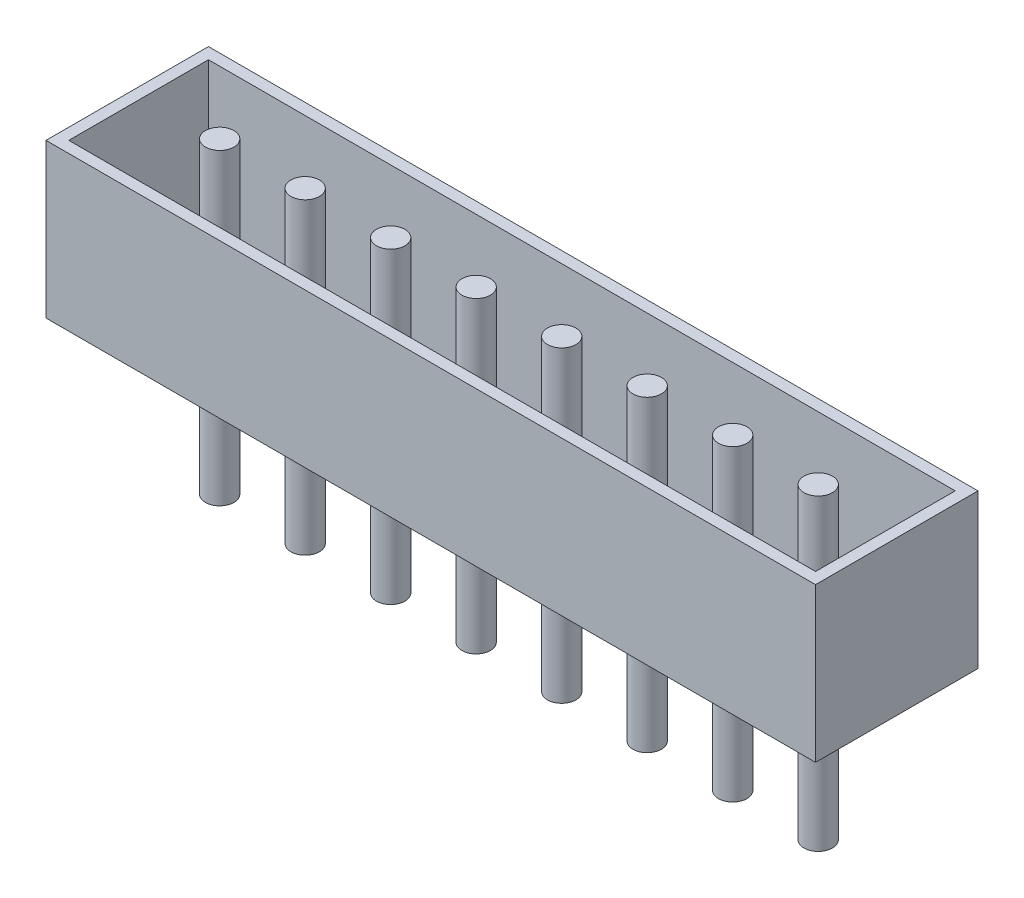
ISO-10303-21;
HEADER;
FILE_DESCRIPTION(('STEP AP214'),'2;1');
FILE_NAME('part.step','',(''),(''),'','','');
FILE_SCHEMA(('AUTOMOTIVE_DESIGN { 1 0 10303 214 1 1 1 1 }'));
ENDSEC;
DATA;
#1=APPLICATION_CONTEXT('core data for automotive mechanical design processes');
#2=APPLICATION_PROTOCOL_DEFINITION('international standard','automotive_design',2000,#1);
#3=PRODUCT_CONTEXT('',#1,'mechanical');
#4=PRODUCT('Part','Part','',(#3));
#5=PRODUCT_RELATED_PRODUCT_CATEGORY('part','',(#4));
#6=PRODUCT_DEFINITION_FORMATION('','',#4);
#7=PRODUCT_DEFINITION_CONTEXT('part definition',#1,'design');
#8=PRODUCT_DEFINITION('design','',#6,#7);
#9=PRODUCT_DEFINITION_SHAPE('','',#8);
#10=(LENGTH_UNIT() NAMED_UNIT(*) SI_UNIT(.MILLI.,.METRE.));
#11=(NAMED_UNIT(*) PLANE_ANGLE_UNIT() SI_UNIT($,.RADIAN.));
#12=(NAMED_UNIT(*) SI_UNIT($,.STERADIAN.) SOLID_ANGLE_UNIT());
#13=UNCERTAINTY_MEASURE_WITH_UNIT(LENGTH_MEASURE(1.E-05),#10,'distance_accuracy_value','');
#14=(GEOMETRIC_REPRESENTATION_CONTEXT(3) GLOBAL_UNCERTAINTY_ASSIGNED_CONTEXT((#13)) GLOBAL_UNIT_ASSIGNED_CONTEXT((#10,
#11,#12)) REPRESENTATION_CONTEXT('',''));
#15=CARTESIAN_POINT('',(0.,0.,0.));
#16=DIRECTION('',(0.,0.,1.));
#17=DIRECTION('',(1.,0.,0.));
#18=AXIS2_PLACEMENT_3D('',#15,#16,#17);
#19=CARTESIAN_POINT('',(2.59669811320755,-2.7,-0.0237028301886787));
#20=DIRECTION('',(0.,1.,0.));
#21=DIRECTION('',(0.,0.,1.));
#22=AXIS2_PLACEMENT_3D('',#19,#20,#21);
#23=CYLINDRICAL_SURFACE('',#22,0.25);
#24=CARTESIAN_POINT('',(2.59669811320755,-2.7,-0.0237028301886787));
#25=DIRECTION('',(0.,1.,0.));
#26=DIRECTION('',(0.,0.,1.));
#27=AXIS2_PLACEMENT_3D('',#24,#25,#26);
#28=CIRCLE('',#27,0.25);
#29=CARTESIAN_POINT('',(2.59669811320755,-2.7,0.226297169811322));
#30=VERTEX_POINT('',#29);
#31=EDGE_CURVE('E79',#30,#30,#28,.T.);
#32=ORIENTED_EDGE('',*,*,#31,.T.);
#33=EDGE_LOOP('',(#32));
#34=FACE_BOUND('',#33,.T.);
#35=CARTESIAN_POINT('',(2.59669811320755,0.,-0.0237028301886787));
#36=DIRECTION('',(0.,1.,0.));
#37=DIRECTION('',(0.,0.,1.));
#38=AXIS2_PLACEMENT_3D('',#35,#36,#37);
#39=CIRCLE('',#38,0.25);
#40=CARTESIAN_POINT('',(2.59669811320755,0.,0.226297169811322));
#41=VERTEX_POINT('',#40);
#42=EDGE_CURVE('E164',#41,#41,#39,.T.);
#43=ORIENTED_EDGE('',*,*,#42,.F.);
#44=EDGE_LOOP('',(#43));
#45=FACE_BOUND('',#44,.T.);
#46=ADVANCED_FACE('F71',(#34,#45),#23,.T.);
#47=CARTESIAN_POINT('',(2.59669811320755,-2.7,-0.0237028301886787));
#48=DIRECTION('',(0.,1.,0.));
#49=DIRECTION('',(0.,0.,1.));
#50=AXIS2_PLACEMENT_3D('',#47,#48,#49);
#51=PLANE('',#50);
#52=ORIENTED_EDGE('',*,*,#31,.F.);
#53=EDGE_LOOP('',(#52));
#54=FACE_BOUND('',#53,.T.);
#55=ADVANCED_FACE('F217',(#54),#51,.F.);
#56=CARTESIAN_POINT('',(0.,2.7,1.32312849744132));
#57=DIRECTION('',(0.,0.,-1.));
#58=DIRECTION('',(-1.,0.,0.));
#59=AXIS2_PLACEMENT_3D('',#56,#57,#58);
#60=PLANE('',#59);
#61=DIRECTION('',(1.,0.,0.));
#62=VECTOR('',#61,1.);
#63=CARTESIAN_POINT('',(0.,0.2,1.32312849744132));
#64=LINE('',#63,#62);
#65=CARTESIAN_POINT('',(-4.70330188679245,0.200000000000001,1.32312849744132));
#66=VERTEX_POINT('',#65);
#67=CARTESIAN_POINT('',(8.39669811320755,0.200000000000001,1.32312849744132));
#68=VERTEX_POINT('',#67);
#69=EDGE_CURVE('E86',#66,#68,#64,.T.);
#70=ORIENTED_EDGE('',*,*,#69,.F.);
#71=DIRECTION('',(0.,-1.,0.));
#72=VECTOR('',#71,1.);
#73=CARTESIAN_POINT('',(-4.70330188679245,2.7,1.32312849744132));
#74=LINE('',#73,#72);
#75=CARTESIAN_POINT('',(-4.70330188679245,2.7,1.32312849744132));
#76=VERTEX_POINT('',#75);
#77=EDGE_CURVE('E146',#76,#66,#74,.T.);
#78=ORIENTED_EDGE('',*,*,#77,.F.);
#79=DIRECTION('',(1.,0.,0.));
#80=VECTOR('',#79,1.);
#81=CARTESIAN_POINT('',(0.,2.7,1.32312849744132));
#82=LINE('',#81,#80);
#83=CARTESIAN_POINT('',(8.39669811320755,2.7,1.32312849744132));
#84=VERTEX_POINT('',#83);
#85=EDGE_CURVE('E172',#76,#84,#82,.T.);
#86=ORIENTED_EDGE('',*,*,#85,.T.);
#87=DIRECTION('',(0.,-1.,0.));
#88=VECTOR('',#87,1.);
#89=CARTESIAN_POINT('',(8.39669811320755,2.7,1.32312849744132));
#90=LINE('',#89,#88);
#91=EDGE_CURVE('E200',#84,#68,#90,.T.);
#92=ORIENTED_EDGE('',*,*,#91,.T.);
#93=EDGE_LOOP('',(#70,#78,#86,#92));
#94=FACE_BOUND('',#93,.T.);
#95=ADVANCED_FACE('F219',(#94),#60,.T.);
#96=CARTESIAN_POINT('',(-4.70330188679245,2.7,0.));
#97=DIRECTION('',(1.,0.,0.));
#98=DIRECTION('',(0.,0.,-1.));
#99=AXIS2_PLACEMENT_3D('',#96,#97,#98);
#100=PLANE('',#99);
#101=DIRECTION('',(0.,0.,1.));
#102=VECTOR('',#101,1.);
#103=CARTESIAN_POINT('',(-4.70330188679245,0.2,0.));
#104=LINE('',#103,#102);
#105=CARTESIAN_POINT('',(-4.70330188679245,0.2,-1.12687150255868));
#106=VERTEX_POINT('',#105);
#107=EDGE_CURVE('E150',#106,#66,#104,.T.);
#108=ORIENTED_EDGE('',*,*,#107,.F.);
#109=DIRECTION('',(0.,-1.,0.));
#110=VECTOR('',#109,1.);
#111=CARTESIAN_POINT('',(-4.70330188679245,2.7,-1.12687150255868));
#112=LINE('',#111,#110);
#113=CARTESIAN_POINT('',(-4.70330188679245,2.7,-1.12687150255868));
#114=VERTEX_POINT('',#113);
#115=EDGE_CURVE('E136',#114,#106,#112,.T.);
#116=ORIENTED_EDGE('',*,*,#115,.F.);
#117=DIRECTION('',(0.,0.,1.));
#118=VECTOR('',#117,1.);
#119=CARTESIAN_POINT('',(-4.70330188679245,2.7,0.));
#120=LINE('',#119,#118);
#121=EDGE_CURVE('E176',#114,#76,#120,.T.);
#122=ORIENTED_EDGE('',*,*,#121,.T.);
#123=ORIENTED_EDGE('',*,*,#77,.T.);
#124=EDGE_LOOP('',(#108,#116,#122,#123));
#125=FACE_BOUND('',#124,.T.);
#126=ADVANCED_FACE('F151',(#125),#100,.T.);
#127=CARTESIAN_POINT('',(-4.90330188679245,2.7,0.));
#128=DIRECTION('',(1.,0.,0.));
#129=DIRECTION('',(0.,0.,-1.));
#130=AXIS2_PLACEMENT_3D('',#127,#128,#129);
#131=PLANE('',#130);
#132=DIRECTION('',(0.,0.,1.));
#133=VECTOR('',#132,1.);
#134=CARTESIAN_POINT('',(-4.90330188679245,0.,0.));
#135=LINE('',#134,#133);
#136=CARTESIAN_POINT('',(-4.90330188679245,0.,-1.32687150255868));
#137=VERTEX_POINT('',#136);
#138=CARTESIAN_POINT('',(-4.90330188679245,0.,1.52312849744132));
#139=VERTEX_POINT('',#138);
#140=EDGE_CURVE('E186',#137,#139,#135,.T.);
#141=ORIENTED_EDGE('',*,*,#140,.T.);
#142=DIRECTION('',(0.,-1.,0.));
#143=VECTOR('',#142,1.);
#144=CARTESIAN_POINT('',(-4.90330188679245,2.7,1.52312849744132));
#145=LINE('',#144,#143);
#146=CARTESIAN_POINT('',(-4.90330188679245,2.7,1.52312849744132));
#147=VERTEX_POINT('',#146);
#148=EDGE_CURVE('E147',#147,#139,#145,.T.);
#149=ORIENTED_EDGE('',*,*,#148,.F.);
#150=DIRECTION('',(0.,0.,1.));
#151=VECTOR('',#150,1.);
#152=CARTESIAN_POINT('',(-4.90330188679245,2.7,0.));
#153=LINE('',#152,#151);
#154=CARTESIAN_POINT('',(-4.90330188679245,2.7,-1.32687150255868));
#155=VERTEX_POINT('',#154);
#156=EDGE_CURVE('E178',#155,#147,#153,.T.);
#157=ORIENTED_EDGE('',*,*,#156,.F.);
#158=DIRECTION('',(0.,-1.,0.));
#159=VECTOR('',#158,1.);
#160=CARTESIAN_POINT('',(-4.90330188679245,2.7,-1.32687150255868));
#161=LINE('',#160,#159);
#162=EDGE_CURVE('E189',#155,#137,#161,.T.);
#163=ORIENTED_EDGE('',*,*,#162,.T.);
#164=EDGE_LOOP('',(#141,#149,#157,#163));
#165=FACE_BOUND('',#164,.T.);
#166=ADVANCED_FACE('F474',(#165),#131,.F.);
#167=CARTESIAN_POINT('',(0.,2.7,1.52312849744132));
#168=DIRECTION('',(0.,0.,-1.));
#169=DIRECTION('',(-1.,0.,0.));
#170=AXIS2_PLACEMENT_3D('',#167,#168,#169);
#171=PLANE('',#170);
#172=DIRECTION('',(1.,0.,0.));
#173=VECTOR('',#172,1.);
#174=CARTESIAN_POINT('',(0.,0.,1.52312849744132));
#175=LINE('',#174,#173);
#176=CARTESIAN_POINT('',(8.59669811320755,0.,1.52312849744132));
#177=VERTEX_POINT('',#176);
#178=EDGE_CURVE('E188',#139,#177,#175,.T.);
#179=ORIENTED_EDGE('',*,*,#178,.T.);
#180=DIRECTION('',(0.,-1.,0.));
#181=VECTOR('',#180,1.);
#182=CARTESIAN_POINT('',(8.59669811320755,2.7,1.52312849744132));
#183=LINE('',#182,#181);
#184=CARTESIAN_POINT('',(8.59669811320755,2.7,1.52312849744132));
#185=VERTEX_POINT('',#184);
#186=EDGE_CURVE('E195',#185,#177,#183,.T.);
#187=ORIENTED_EDGE('',*,*,#186,.F.);
#188=DIRECTION('',(1.,0.,0.));
#189=VECTOR('',#188,1.);
#190=CARTESIAN_POINT('',(0.,2.7,1.52312849744132));
#191=LINE('',#190,#189);
#192=EDGE_CURVE('E180',#147,#185,#191,.T.);
#193=ORIENTED_EDGE('',*,*,#192,.F.);
#194=ORIENTED_EDGE('',*,*,#148,.T.);
#195=EDGE_LOOP('',(#179,#187,#193,#194));
#196=FACE_BOUND('',#195,.T.);
#197=ADVANCED_FACE('F470',(#196),#171,.F.);
#198=CARTESIAN_POINT('',(8.59669811320755,2.7,0.));
#199=DIRECTION('',(1.,0.,0.));
#200=DIRECTION('',(0.,0.,-1.));
#201=AXIS2_PLACEMENT_3D('',#198,#199,#200);
#202=PLANE('',#201);
#203=DIRECTION('',(0.,0.,1.));
#204=VECTOR('',#203,1.);
#205=CARTESIAN_POINT('',(8.59669811320755,0.,0.));
#206=LINE('',#205,#204);
#207=CARTESIAN_POINT('',(8.59669811320755,0.,-1.32687150255868));
#208=VERTEX_POINT('',#207);
#209=EDGE_CURVE('E173',#208,#177,#206,.T.);
#210=ORIENTED_EDGE('',*,*,#209,.F.);
#211=DIRECTION('',(0.,-1.,0.));
#212=VECTOR('',#211,1.);
#213=CARTESIAN_POINT('',(8.59669811320755,2.7,-1.32687150255868));
#214=LINE('',#213,#212);
#215=CARTESIAN_POINT('',(8.59669811320755,2.7,-1.32687150255868));
#216=VERTEX_POINT('',#215);
#217=EDGE_CURVE('E205',#216,#208,#214,.T.);
#218=ORIENTED_EDGE('',*,*,#217,.F.);
#219=DIRECTION('',(0.,0.,1.));
#220=VECTOR('',#219,1.);
#221=CARTESIAN_POINT('',(8.59669811320755,2.7,0.));
#222=LINE('',#221,#220);
#223=EDGE_CURVE('E182',#216,#185,#222,.T.);
#224=ORIENTED_EDGE('',*,*,#223,.T.);
#225=ORIENTED_EDGE('',*,*,#186,.T.);
#226=EDGE_LOOP('',(#210,#218,#224,#225));
#227=FACE_BOUND('',#226,.T.);
#228=ADVANCED_FACE('F467',(#227),#202,.T.);
#229=CARTESIAN_POINT('',(8.39669811320755,2.7,0.));
#230=DIRECTION('',(-1.,0.,0.));
#231=DIRECTION('',(0.,0.,1.));
#232=AXIS2_PLACEMENT_3D('',#229,#230,#231);
#233=PLANE('',#232);
#234=DIRECTION('',(0.,0.,-1.));
#235=VECTOR('',#234,1.);
#236=CARTESIAN_POINT('',(8.39669811320755,0.2,0.));
#237=LINE('',#236,#235);
#238=CARTESIAN_POINT('',(8.39669811320755,0.200000000000001,-1.12687150255868));
#239=VERTEX_POINT('',#238);
#240=EDGE_CURVE('E94',#68,#239,#237,.T.);
#241=ORIENTED_EDGE('',*,*,#240,.F.);
#242=ORIENTED_EDGE('',*,*,#91,.F.);
#243=DIRECTION('',(0.,0.,-1.));
#244=VECTOR('',#243,1.);
#245=CARTESIAN_POINT('',(8.39669811320755,2.7,0.));
#246=LINE('',#245,#244);
#247=CARTESIAN_POINT('',(8.39669811320755,2.7,-1.12687150255868));
#248=VERTEX_POINT('',#247);
#249=EDGE_CURVE('E169',#84,#248,#246,.T.);
#250=ORIENTED_EDGE('',*,*,#249,.T.);
#251=DIRECTION('',(0.,-1.,0.));
#252=VECTOR('',#251,1.);
#253=CARTESIAN_POINT('',(8.39669811320755,2.7,-1.12687150255868));
#254=LINE('',#253,#252);
#255=EDGE_CURVE('E185',#248,#239,#254,.T.);
#256=ORIENTED_EDGE('',*,*,#255,.T.);
#257=EDGE_LOOP('',(#241,#242,#250,#256));
#258=FACE_BOUND('',#257,.T.);
#259=ADVANCED_FACE('F466',(#258),#233,.T.);
#260=CARTESIAN_POINT('',(0.,0.,0.));
#261=DIRECTION('',(0.,1.,0.));
#262=DIRECTION('',(0.,0.,1.));
#263=AXIS2_PLACEMENT_3D('',#260,#261,#262);
#264=PLANE('',#263);
#265=CARTESIAN_POINT('',(-1.90330188679245,0.,-0.0237028301886787));
#266=DIRECTION('',(0.,1.,0.));
#267=DIRECTION('',(0.,0.,1.));
#268=AXIS2_PLACEMENT_3D('',#265,#266,#267);
#269=CIRCLE('',#268,0.25);
#270=CARTESIAN_POINT('',(-1.90330188679245,0.,0.226297169811322));
#271=VERTEX_POINT('',#270);
#272=EDGE_CURVE('E342',#271,#271,#269,.T.);
#273=ORIENTED_EDGE('',*,*,#272,.T.);
#274=EDGE_LOOP('',(#273));
#275=FACE_BOUND('',#274,.T.);
#276=CARTESIAN_POINT('',(7.09669811320755,0.,-0.0237028301886787));
#277=DIRECTION('',(0.,1.,0.));
#278=DIRECTION('',(0.,0.,1.));
#279=AXIS2_PLACEMENT_3D('',#276,#277,#278);
#280=CIRCLE('',#279,0.250000000000001);
#281=CARTESIAN_POINT('',(7.09669811320755,0.,0.226297169811323));
#282=VERTEX_POINT('',#281);
#283=EDGE_CURVE('E333',#282,#282,#280,.T.);
#284=ORIENTED_EDGE('',*,*,#283,.T.);
#285=EDGE_LOOP('',(#284));
#286=FACE_BOUND('',#285,.T.);
#287=CARTESIAN_POINT('',(5.59669811320755,0.,-0.0237028301886787));
#288=DIRECTION('',(0.,1.,0.));
#289=DIRECTION('',(0.,0.,1.));
#290=AXIS2_PLACEMENT_3D('',#287,#288,#289);
#291=CIRCLE('',#290,0.250000000000001);
#292=CARTESIAN_POINT('',(5.59669811320755,0.,0.226297169811323));
#293=VERTEX_POINT('',#292);
#294=EDGE_CURVE('E324',#293,#293,#291,.T.);
#295=ORIENTED_EDGE('',*,*,#294,.T.);
#296=EDGE_LOOP('',(#295));
#297=FACE_BOUND('',#296,.T.);
#298=CARTESIAN_POINT('',(4.09669811320755,0.,-0.0237028301886787));
#299=DIRECTION('',(0.,1.,0.));
#300=DIRECTION('',(0.,0.,1.));
#301=AXIS2_PLACEMENT_3D('',#298,#299,#300);
#302=CIRCLE('',#301,0.250000000000001);
#303=CARTESIAN_POINT('',(4.09669811320755,0.,0.226297169811323));
#304=VERTEX_POINT('',#303);
#305=EDGE_CURVE('E315',#304,#304,#302,.T.);
#306=ORIENTED_EDGE('',*,*,#305,.T.);
#307=EDGE_LOOP('',(#306));
#308=FACE_BOUND('',#307,.T.);
#309=CARTESIAN_POINT('',(1.09669811320755,0.,-0.0237028301886787));
#310=DIRECTION('',(0.,1.,0.));
#311=DIRECTION('',(0.,0.,1.));
#312=AXIS2_PLACEMENT_3D('',#309,#310,#311);
#313=CIRCLE('',#312,0.25);
#314=CARTESIAN_POINT('',(1.09669811320755,0.,0.226297169811322));
#315=VERTEX_POINT('',#314);
#316=EDGE_CURVE('E306',#315,#315,#313,.T.);
#317=ORIENTED_EDGE('',*,*,#316,.T.);
#318=EDGE_LOOP('',(#317));
#319=FACE_BOUND('',#318,.T.);
#320=CARTESIAN_POINT('',(-0.40330188679245,0.,-0.0237028301886787));
#321=DIRECTION('',(0.,1.,0.));
#322=DIRECTION('',(0.,0.,1.));
#323=AXIS2_PLACEMENT_3D('',#320,#321,#322);
#324=CIRCLE('',#323,0.25);
#325=CARTESIAN_POINT('',(-0.40330188679245,0.,0.226297169811322));
#326=VERTEX_POINT('',#325);
#327=EDGE_CURVE('E297',#326,#326,#324,.T.);
#328=ORIENTED_EDGE('',*,*,#327,.T.);
#329=EDGE_LOOP('',(#328));
#330=FACE_BOUND('',#329,.T.);
#331=CARTESIAN_POINT('',(-3.40330188679245,0.,-0.0237028301886787));
#332=DIRECTION('',(0.,1.,0.));
#333=DIRECTION('',(0.,0.,1.));
#334=AXIS2_PLACEMENT_3D('',#331,#332,#333);
#335=CIRCLE('',#334,0.25);
#336=CARTESIAN_POINT('',(-3.40330188679245,0.,0.226297169811322));
#337=VERTEX_POINT('',#336);
#338=EDGE_CURVE('E288',#337,#337,#335,.T.);
#339=ORIENTED_EDGE('',*,*,#338,.T.);
#340=EDGE_LOOP('',(#339));
#341=FACE_BOUND('',#340,.T.);
#342=ORIENTED_EDGE('',*,*,#140,.F.);
#343=DIRECTION('',(-1.,0.,0.));
#344=VECTOR('',#343,1.);
#345=CARTESIAN_POINT('',(8.59669811320755,0.,-1.32687150255868));
#346=LINE('',#345,#344);
#347=EDGE_CURVE('E156',#208,#137,#346,.T.);
#348=ORIENTED_EDGE('',*,*,#347,.F.);
#349=ORIENTED_EDGE('',*,*,#209,.T.);
#350=ORIENTED_EDGE('',*,*,#178,.F.);
#351=EDGE_LOOP('',(#342,#348,#349,#350));
#352=FACE_BOUND('',#351,.T.);
#353=ORIENTED_EDGE('',*,*,#42,.T.);
#354=EDGE_LOOP('',(#353));
#355=FACE_BOUND('',#354,.T.);
#356=ADVANCED_FACE('F349',(#275,#286,#297,#308,#319,#330,#341,#352,#355),#264,.F.);
#357=CARTESIAN_POINT('',(0.,2.7,0.));
#358=DIRECTION('',(0.,1.,0.));
#359=DIRECTION('',(0.,0.,1.));
#360=AXIS2_PLACEMENT_3D('',#357,#358,#359);
#361=PLANE('',#360);
#362=DIRECTION('',(-1.,0.,0.));
#363=VECTOR('',#362,1.);
#364=CARTESIAN_POINT('',(8.59669811320755,2.7,-1.32687150255868));
#365=LINE('',#364,#363);
#366=EDGE_CURVE('E159',#216,#155,#365,.T.);
#367=ORIENTED_EDGE('',*,*,#366,.T.);
#368=ORIENTED_EDGE('',*,*,#156,.T.);
#369=ORIENTED_EDGE('',*,*,#192,.T.);
#370=ORIENTED_EDGE('',*,*,#223,.F.);
#371=EDGE_LOOP('',(#367,#368,#369,#370));
#372=FACE_BOUND('',#371,.T.);
#373=ORIENTED_EDGE('',*,*,#249,.F.);
#374=ORIENTED_EDGE('',*,*,#85,.F.);
#375=ORIENTED_EDGE('',*,*,#121,.F.);
#376=DIRECTION('',(-1.,0.,0.));
#377=VECTOR('',#376,1.);
#378=CARTESIAN_POINT('',(8.59669811320755,2.7,-1.12687150255868));
#379=LINE('',#378,#377);
#380=EDGE_CURVE('E142',#248,#114,#379,.T.);
#381=ORIENTED_EDGE('',*,*,#380,.F.);
#382=EDGE_LOOP('',(#373,#374,#375,#381));
#383=FACE_BOUND('',#382,.T.);
#384=ADVANCED_FACE('F237',(#372,#383),#361,.T.);
#385=CARTESIAN_POINT('',(8.59669811320755,2.7,-1.12687150255868));
#386=DIRECTION('',(0.,0.,1.));
#387=DIRECTION('',(1.,0.,0.));
#388=AXIS2_PLACEMENT_3D('',#385,#386,#387);
#389=PLANE('',#388);
#390=DIRECTION('',(-1.,0.,0.));
#391=VECTOR('',#390,1.);
#392=CARTESIAN_POINT('',(0.,0.2,-1.12687150255868));
#393=LINE('',#392,#391);
#394=EDGE_CURVE('E140',#239,#106,#393,.T.);
#395=ORIENTED_EDGE('',*,*,#394,.F.);
#396=ORIENTED_EDGE('',*,*,#255,.F.);
#397=ORIENTED_EDGE('',*,*,#380,.T.);
#398=ORIENTED_EDGE('',*,*,#115,.T.);
#399=EDGE_LOOP('',(#395,#396,#397,#398));
#400=FACE_BOUND('',#399,.T.);
#401=ADVANCED_FACE('F138',(#400),#389,.T.);
#402=CARTESIAN_POINT('',(8.59669811320755,2.7,-1.32687150255868));
#403=DIRECTION('',(0.,0.,1.));
#404=DIRECTION('',(1.,0.,0.));
#405=AXIS2_PLACEMENT_3D('',#402,#403,#404);
#406=PLANE('',#405);
#407=ORIENTED_EDGE('',*,*,#347,.T.);
#408=ORIENTED_EDGE('',*,*,#162,.F.);
#409=ORIENTED_EDGE('',*,*,#366,.F.);
#410=ORIENTED_EDGE('',*,*,#217,.T.);
#411=EDGE_LOOP('',(#407,#408,#409,#410));
#412=FACE_BOUND('',#411,.T.);
#413=ADVANCED_FACE('F220',(#412),#406,.F.);
#414=CARTESIAN_POINT('',(0.,0.2,0.));
#415=DIRECTION('',(0.,1.,0.));
#416=DIRECTION('',(0.,0.,1.));
#417=AXIS2_PLACEMENT_3D('',#414,#415,#416);
#418=PLANE('',#417);
#419=CARTESIAN_POINT('',(7.09669811320755,0.2,-0.0237028301886787));
#420=DIRECTION('',(0.,1.,0.));
#421=DIRECTION('',(0.,0.,1.));
#422=AXIS2_PLACEMENT_3D('',#419,#420,#421);
#423=CIRCLE('',#422,0.250000000000001);
#424=CARTESIAN_POINT('',(7.09669811320755,0.2,0.226297169811323));
#425=VERTEX_POINT('',#424);
#426=EDGE_CURVE('E167',#425,#425,#423,.T.);
#427=ORIENTED_EDGE('',*,*,#426,.F.);
#428=EDGE_LOOP('',(#427));
#429=FACE_BOUND('',#428,.T.);
#430=CARTESIAN_POINT('',(5.59669811320755,0.2,-0.0237028301886787));
#431=DIRECTION('',(0.,1.,0.));
#432=DIRECTION('',(0.,0.,1.));
#433=AXIS2_PLACEMENT_3D('',#430,#431,#432);
#434=CIRCLE('',#433,0.250000000000001);
#435=CARTESIAN_POINT('',(5.59669811320755,0.2,0.226297169811323));
#436=VERTEX_POINT('',#435);
#437=EDGE_CURVE('E281',#436,#436,#434,.T.);
#438=ORIENTED_EDGE('',*,*,#437,.F.);
#439=EDGE_LOOP('',(#438));
#440=FACE_BOUND('',#439,.T.);
#441=CARTESIAN_POINT('',(4.09669811320755,0.2,-0.0237028301886787));
#442=DIRECTION('',(0.,1.,0.));
#443=DIRECTION('',(0.,0.,1.));
#444=AXIS2_PLACEMENT_3D('',#441,#442,#443);
#445=CIRCLE('',#444,0.250000000000001);
#446=CARTESIAN_POINT('',(4.09669811320755,0.2,0.226297169811323));
#447=VERTEX_POINT('',#446);
#448=EDGE_CURVE('E278',#447,#447,#445,.T.);
#449=ORIENTED_EDGE('',*,*,#448,.F.);
#450=EDGE_LOOP('',(#449));
#451=FACE_BOUND('',#450,.T.);
#452=CARTESIAN_POINT('',(2.59669811320755,0.2,-0.0237028301886787));
#453=DIRECTION('',(0.,1.,0.));
#454=DIRECTION('',(0.,0.,1.));
#455=AXIS2_PLACEMENT_3D('',#452,#453,#454);
#456=CIRCLE('',#455,0.25);
#457=CARTESIAN_POINT('',(2.59669811320755,0.2,0.226297169811322));
#458=VERTEX_POINT('',#457);
#459=EDGE_CURVE('E12',#458,#458,#456,.F.);
#460=ORIENTED_EDGE('',*,*,#459,.T.);
#461=EDGE_LOOP('',(#460));
#462=FACE_BOUND('',#461,.T.);
#463=CARTESIAN_POINT('',(1.09669811320755,0.2,-0.0237028301886787));
#464=DIRECTION('',(0.,1.,0.));
#465=DIRECTION('',(0.,0.,1.));
#466=AXIS2_PLACEMENT_3D('',#463,#464,#465);
#467=CIRCLE('',#466,0.25);
#468=CARTESIAN_POINT('',(1.09669811320755,0.2,0.226297169811322));
#469=VERTEX_POINT('',#468);
#470=EDGE_CURVE('E261',#469,#469,#467,.T.);
#471=ORIENTED_EDGE('',*,*,#470,.F.);
#472=EDGE_LOOP('',(#471));
#473=FACE_BOUND('',#472,.T.);
#474=CARTESIAN_POINT('',(-0.40330188679245,0.2,-0.0237028301886787));
#475=DIRECTION('',(0.,1.,0.));
#476=DIRECTION('',(0.,0.,1.));
#477=AXIS2_PLACEMENT_3D('',#474,#475,#476);
#478=CIRCLE('',#477,0.25);
#479=CARTESIAN_POINT('',(-0.40330188679245,0.2,0.226297169811322));
#480=VERTEX_POINT('',#479);
#481=EDGE_CURVE('E265',#480,#480,#478,.T.);
#482=ORIENTED_EDGE('',*,*,#481,.F.);
#483=EDGE_LOOP('',(#482));
#484=FACE_BOUND('',#483,.T.);
#485=CARTESIAN_POINT('',(-1.90330188679245,0.2,-0.0237028301886787));
#486=DIRECTION('',(0.,1.,0.));
#487=DIRECTION('',(0.,0.,1.));
#488=AXIS2_PLACEMENT_3D('',#485,#486,#487);
#489=CIRCLE('',#488,0.25);
#490=CARTESIAN_POINT('',(-1.90330188679245,0.2,0.226297169811322));
#491=VERTEX_POINT('',#490);
#492=EDGE_CURVE('E269',#491,#491,#489,.T.);
#493=ORIENTED_EDGE('',*,*,#492,.F.);
#494=EDGE_LOOP('',(#493));
#495=FACE_BOUND('',#494,.T.);
#496=CARTESIAN_POINT('',(-3.40330188679245,0.2,-0.0237028301886787));
#497=DIRECTION('',(0.,1.,0.));
#498=DIRECTION('',(0.,0.,1.));
#499=AXIS2_PLACEMENT_3D('',#496,#497,#498);
#500=CIRCLE('',#499,0.25);
#501=CARTESIAN_POINT('',(-3.40330188679245,0.2,0.226297169811322));
#502=VERTEX_POINT('',#501);
#503=EDGE_CURVE('E153',#502,#502,#500,.T.);
#504=ORIENTED_EDGE('',*,*,#503,.F.);
#505=EDGE_LOOP('',(#504));
#506=FACE_BOUND('',#505,.T.);
#507=ORIENTED_EDGE('',*,*,#107,.T.);
#508=ORIENTED_EDGE('',*,*,#69,.T.);
#509=ORIENTED_EDGE('',*,*,#240,.T.);
#510=ORIENTED_EDGE('',*,*,#394,.T.);
#511=EDGE_LOOP('',(#507,#508,#509,#510));
#512=FACE_BOUND('',#511,.T.);
#513=ADVANCED_FACE('F155',(#429,#440,#451,#462,#473,#484,#495,#506,#512),#418,.T.);
#514=CARTESIAN_POINT('',(0.,2.7,0.));
#515=DIRECTION('',(0.,1.,0.));
#516=DIRECTION('',(0.,0.,1.));
#517=AXIS2_PLACEMENT_3D('',#514,#515,#516);
#518=PLANE('',#517);
#519=CARTESIAN_POINT('',(2.59669811320755,2.7,-0.0237028301886787));
#520=DIRECTION('',(0.,1.,0.));
#521=DIRECTION('',(0.,0.,1.));
#522=AXIS2_PLACEMENT_3D('',#519,#520,#521);
#523=CIRCLE('',#522,0.25);
#524=CARTESIAN_POINT('',(2.59669811320755,2.7,0.226297169811322));
#525=VERTEX_POINT('',#524);
#526=EDGE_CURVE('E202',#525,#525,#523,.T.);
#527=ORIENTED_EDGE('',*,*,#526,.T.);
#528=EDGE_LOOP('',(#527));
#529=FACE_BOUND('',#528,.T.);
#530=ADVANCED_FACE('F234',(#529),#518,.T.);
#531=ORIENTED_EDGE('',*,*,#459,.F.);
#532=EDGE_LOOP('',(#531));
#533=FACE_BOUND('',#532,.T.);
#534=ORIENTED_EDGE('',*,*,#526,.F.);
#535=EDGE_LOOP('',(#534));
#536=FACE_BOUND('',#535,.T.);
#537=ADVANCED_FACE('F73',(#533,#536),#23,.T.);
#538=CARTESIAN_POINT('',(0.,2.7,0.));
#539=DIRECTION('',(0.,1.,0.));
#540=DIRECTION('',(0.,0.,1.));
#541=AXIS2_PLACEMENT_3D('',#538,#539,#540);
#542=PLANE('',#541);
#543=CARTESIAN_POINT('',(-3.40330188679245,2.7,-0.0237028301886787));
#544=DIRECTION('',(0.,1.,0.));
#545=DIRECTION('',(0.,0.,1.));
#546=AXIS2_PLACEMENT_3D('',#543,#544,#545);
#547=CIRCLE('',#546,0.25);
#548=CARTESIAN_POINT('',(-3.40330188679245,2.7,0.226297169811322));
#549=VERTEX_POINT('',#548);
#550=EDGE_CURVE('E168',#549,#549,#547,.T.);
#551=ORIENTED_EDGE('',*,*,#550,.T.);
#552=EDGE_LOOP('',(#551));
#553=FACE_BOUND('',#552,.T.);
#554=ADVANCED_FACE('F245',(#553),#542,.T.);
#555=CARTESIAN_POINT('',(-3.40330188679245,2.7,-0.0237028301886787));
#556=DIRECTION('',(0.,-1.,0.));
#557=DIRECTION('',(0.,0.,-1.));
#558=AXIS2_PLACEMENT_3D('',#555,#556,#557);
#559=CYLINDRICAL_SURFACE('',#558,0.25);
#560=ORIENTED_EDGE('',*,*,#503,.T.);
#561=EDGE_LOOP('',(#560));
#562=FACE_BOUND('',#561,.T.);
#563=ORIENTED_EDGE('',*,*,#550,.F.);
#564=EDGE_LOOP('',(#563));
#565=FACE_BOUND('',#564,.T.);
#566=ADVANCED_FACE('F252',(#562,#565),#559,.T.);
#567=CARTESIAN_POINT('',(-3.40330188679245,-2.7,-0.0237028301886787));
#568=DIRECTION('',(0.,1.,0.));
#569=DIRECTION('',(0.,0.,1.));
#570=AXIS2_PLACEMENT_3D('',#567,#568,#569);
#571=CYLINDRICAL_SURFACE('',#570,0.25);
#572=CARTESIAN_POINT('',(-3.40330188679245,-2.7,-0.0237028301886787));
#573=DIRECTION('',(0.,1.,0.));
#574=DIRECTION('',(0.,0.,1.));
#575=AXIS2_PLACEMENT_3D('',#572,#573,#574);
#576=CIRCLE('',#575,0.25);
#577=CARTESIAN_POINT('',(-3.40330188679245,-2.7,0.226297169811322));
#578=VERTEX_POINT('',#577);
#579=EDGE_CURVE('E289',#578,#578,#576,.T.);
#580=ORIENTED_EDGE('',*,*,#579,.T.);
#581=EDGE_LOOP('',(#580));
#582=FACE_BOUND('',#581,.T.);
#583=ORIENTED_EDGE('',*,*,#338,.F.);
#584=EDGE_LOOP('',(#583));
#585=FACE_BOUND('',#584,.T.);
#586=ADVANCED_FACE('F452',(#582,#585),#571,.T.);
#587=CARTESIAN_POINT('',(-3.40330188679245,-2.7,-0.0237028301886787));
#588=DIRECTION('',(0.,1.,0.));
#589=DIRECTION('',(0.,0.,1.));
#590=AXIS2_PLACEMENT_3D('',#587,#588,#589);
#591=PLANE('',#590);
#592=ORIENTED_EDGE('',*,*,#579,.F.);
#593=EDGE_LOOP('',(#592));
#594=FACE_BOUND('',#593,.T.);
#595=ADVANCED_FACE('F450',(#594),#591,.F.);
#596=CARTESIAN_POINT('',(0.,2.7,0.));
#597=DIRECTION('',(0.,1.,0.));
#598=DIRECTION('',(0.,0.,1.));
#599=AXIS2_PLACEMENT_3D('',#596,#597,#598);
#600=PLANE('',#599);
#601=CARTESIAN_POINT('',(-0.40330188679245,2.7,-0.0237028301886787));
#602=DIRECTION('',(0.,1.,0.));
#603=DIRECTION('',(0.,0.,1.));
#604=AXIS2_PLACEMENT_3D('',#601,#602,#603);
#605=CIRCLE('',#604,0.25);
#606=CARTESIAN_POINT('',(-0.40330188679245,2.7,0.226297169811322));
#607=VERTEX_POINT('',#606);
#608=EDGE_CURVE('E292',#607,#607,#605,.T.);
#609=ORIENTED_EDGE('',*,*,#608,.T.);
#610=EDGE_LOOP('',(#609));
#611=FACE_BOUND('',#610,.T.);
#612=ADVANCED_FACE('F446',(#611),#600,.T.);
#613=CARTESIAN_POINT('',(-0.40330188679245,2.7,-0.0237028301886787));
#614=DIRECTION('',(0.,-1.,0.));
#615=DIRECTION('',(0.,0.,-1.));
#616=AXIS2_PLACEMENT_3D('',#613,#614,#615);
#617=CYLINDRICAL_SURFACE('',#616,0.25);
#618=ORIENTED_EDGE('',*,*,#481,.T.);
#619=EDGE_LOOP('',(#618));
#620=FACE_BOUND('',#619,.T.);
#621=ORIENTED_EDGE('',*,*,#608,.F.);
#622=EDGE_LOOP('',(#621));
#623=FACE_BOUND('',#622,.T.);
#624=ADVANCED_FACE('F439',(#620,#623),#617,.T.);
#625=CARTESIAN_POINT('',(-0.40330188679245,-2.7,-0.0237028301886787));
#626=DIRECTION('',(0.,1.,0.));
#627=DIRECTION('',(0.,0.,1.));
#628=AXIS2_PLACEMENT_3D('',#625,#626,#627);
#629=CYLINDRICAL_SURFACE('',#628,0.25);
#630=CARTESIAN_POINT('',(-0.40330188679245,-2.7,-0.0237028301886787));
#631=DIRECTION('',(0.,1.,0.));
#632=DIRECTION('',(0.,0.,1.));
#633=AXIS2_PLACEMENT_3D('',#630,#631,#632);
#634=CIRCLE('',#633,0.25);
#635=CARTESIAN_POINT('',(-0.40330188679245,-2.7,0.226297169811322));
#636=VERTEX_POINT('',#635);
#637=EDGE_CURVE('E298',#636,#636,#634,.T.);
#638=ORIENTED_EDGE('',*,*,#637,.T.);
#639=EDGE_LOOP('',(#638));
#640=FACE_BOUND('',#639,.T.);
#641=ORIENTED_EDGE('',*,*,#327,.F.);
#642=EDGE_LOOP('',(#641));
#643=FACE_BOUND('',#642,.T.);
#644=ADVANCED_FACE('F436',(#640,#643),#629,.T.);
#645=CARTESIAN_POINT('',(-0.40330188679245,-2.7,-0.0237028301886787));
#646=DIRECTION('',(0.,1.,0.));
#647=DIRECTION('',(0.,0.,1.));
#648=AXIS2_PLACEMENT_3D('',#645,#646,#647);
#649=PLANE('',#648);
#650=ORIENTED_EDGE('',*,*,#637,.F.);
#651=EDGE_LOOP('',(#650));
#652=FACE_BOUND('',#651,.T.);
#653=ADVANCED_FACE('F434',(#652),#649,.F.);
#654=CARTESIAN_POINT('',(0.,2.7,0.));
#655=DIRECTION('',(0.,1.,0.));
#656=DIRECTION('',(0.,0.,1.));
#657=AXIS2_PLACEMENT_3D('',#654,#655,#656);
#658=PLANE('',#657);
#659=CARTESIAN_POINT('',(1.09669811320755,2.7,-0.0237028301886787));
#660=DIRECTION('',(0.,1.,0.));
#661=DIRECTION('',(0.,0.,1.));
#662=AXIS2_PLACEMENT_3D('',#659,#660,#661);
#663=CIRCLE('',#662,0.25);
#664=CARTESIAN_POINT('',(1.09669811320755,2.7,0.226297169811322));
#665=VERTEX_POINT('',#664);
#666=EDGE_CURVE('E301',#665,#665,#663,.T.);
#667=ORIENTED_EDGE('',*,*,#666,.T.);
#668=EDGE_LOOP('',(#667));
#669=FACE_BOUND('',#668,.T.);
#670=ADVANCED_FACE('F430',(#669),#658,.T.);
#671=CARTESIAN_POINT('',(1.09669811320755,2.7,-0.0237028301886787));
#672=DIRECTION('',(0.,-1.,0.));
#673=DIRECTION('',(0.,0.,-1.));
#674=AXIS2_PLACEMENT_3D('',#671,#672,#673);
#675=CYLINDRICAL_SURFACE('',#674,0.25);
#676=ORIENTED_EDGE('',*,*,#470,.T.);
#677=EDGE_LOOP('',(#676));
#678=FACE_BOUND('',#677,.T.);
#679=ORIENTED_EDGE('',*,*,#666,.F.);
#680=EDGE_LOOP('',(#679));
#681=FACE_BOUND('',#680,.T.);
#682=ADVANCED_FACE('F423',(#678,#681),#675,.T.);
#683=CARTESIAN_POINT('',(1.09669811320755,-2.7,-0.0237028301886787));
#684=DIRECTION('',(0.,1.,0.));
#685=DIRECTION('',(0.,0.,1.));
#686=AXIS2_PLACEMENT_3D('',#683,#684,#685);
#687=CYLINDRICAL_SURFACE('',#686,0.25);
#688=CARTESIAN_POINT('',(1.09669811320755,-2.7,-0.0237028301886787));
#689=DIRECTION('',(0.,1.,0.));
#690=DIRECTION('',(0.,0.,1.));
#691=AXIS2_PLACEMENT_3D('',#688,#689,#690);
#692=CIRCLE('',#691,0.25);
#693=CARTESIAN_POINT('',(1.09669811320755,-2.7,0.226297169811322));
#694=VERTEX_POINT('',#693);
#695=EDGE_CURVE('E307',#694,#694,#692,.T.);
#696=ORIENTED_EDGE('',*,*,#695,.T.);
#697=EDGE_LOOP('',(#696));
#698=FACE_BOUND('',#697,.T.);
#699=ORIENTED_EDGE('',*,*,#316,.F.);
#700=EDGE_LOOP('',(#699));
#701=FACE_BOUND('',#700,.T.);
#702=ADVANCED_FACE('F420',(#698,#701),#687,.T.);
#703=CARTESIAN_POINT('',(1.09669811320755,-2.7,-0.0237028301886787));
#704=DIRECTION('',(0.,1.,0.));
#705=DIRECTION('',(0.,0.,1.));
#706=AXIS2_PLACEMENT_3D('',#703,#704,#705);
#707=PLANE('',#706);
#708=ORIENTED_EDGE('',*,*,#695,.F.);
#709=EDGE_LOOP('',(#708));
#710=FACE_BOUND('',#709,.T.);
#711=ADVANCED_FACE('F418',(#710),#707,.F.);
#712=CARTESIAN_POINT('',(0.,2.7,0.));
#713=DIRECTION('',(0.,1.,0.));
#714=DIRECTION('',(0.,0.,1.));
#715=AXIS2_PLACEMENT_3D('',#712,#713,#714);
#716=PLANE('',#715);
#717=CARTESIAN_POINT('',(4.09669811320755,2.7,-0.0237028301886787));
#718=DIRECTION('',(0.,1.,0.));
#719=DIRECTION('',(0.,0.,1.));
#720=AXIS2_PLACEMENT_3D('',#717,#718,#719);
#721=CIRCLE('',#720,0.250000000000001);
#722=CARTESIAN_POINT('',(4.09669811320755,2.7,0.226297169811323));
#723=VERTEX_POINT('',#722);
#724=EDGE_CURVE('E310',#723,#723,#721,.T.);
#725=ORIENTED_EDGE('',*,*,#724,.T.);
#726=EDGE_LOOP('',(#725));
#727=FACE_BOUND('',#726,.T.);
#728=ADVANCED_FACE('F414',(#727),#716,.T.);
#729=CARTESIAN_POINT('',(4.09669811320755,2.7,-0.0237028301886787));
#730=DIRECTION('',(0.,-1.,0.));
#731=DIRECTION('',(0.,0.,-1.));
#732=AXIS2_PLACEMENT_3D('',#729,#730,#731);
#733=CYLINDRICAL_SURFACE('',#732,0.250000000000001);
#734=ORIENTED_EDGE('',*,*,#448,.T.);
#735=EDGE_LOOP('',(#734));
#736=FACE_BOUND('',#735,.T.);
#737=ORIENTED_EDGE('',*,*,#724,.F.);
#738=EDGE_LOOP('',(#737));
#739=FACE_BOUND('',#738,.T.);
#740=ADVANCED_FACE('F407',(#736,#739),#733,.T.);
#741=CARTESIAN_POINT('',(4.09669811320755,-2.7,-0.0237028301886787));
#742=DIRECTION('',(0.,1.,0.));
#743=DIRECTION('',(0.,0.,1.));
#744=AXIS2_PLACEMENT_3D('',#741,#742,#743);
#745=CYLINDRICAL_SURFACE('',#744,0.250000000000001);
#746=CARTESIAN_POINT('',(4.09669811320755,-2.7,-0.0237028301886787));
#747=DIRECTION('',(0.,1.,0.));
#748=DIRECTION('',(0.,0.,1.));
#749=AXIS2_PLACEMENT_3D('',#746,#747,#748);
#750=CIRCLE('',#749,0.250000000000001);
#751=CARTESIAN_POINT('',(4.09669811320755,-2.7,0.226297169811323));
#752=VERTEX_POINT('',#751);
#753=EDGE_CURVE('E316',#752,#752,#750,.T.);
#754=ORIENTED_EDGE('',*,*,#753,.T.);
#755=EDGE_LOOP('',(#754));
#756=FACE_BOUND('',#755,.T.);
#757=ORIENTED_EDGE('',*,*,#305,.F.);
#758=EDGE_LOOP('',(#757));
#759=FACE_BOUND('',#758,.T.);
#760=ADVANCED_FACE('F404',(#756,#759),#745,.T.);
#761=CARTESIAN_POINT('',(4.09669811320755,-2.7,-0.0237028301886787));
#762=DIRECTION('',(0.,1.,0.));
#763=DIRECTION('',(0.,0.,1.));
#764=AXIS2_PLACEMENT_3D('',#761,#762,#763);
#765=PLANE('',#764);
#766=ORIENTED_EDGE('',*,*,#753,.F.);
#767=EDGE_LOOP('',(#766));
#768=FACE_BOUND('',#767,.T.);
#769=ADVANCED_FACE('F402',(#768),#765,.F.);
#770=CARTESIAN_POINT('',(0.,2.7,0.));
#771=DIRECTION('',(0.,1.,0.));
#772=DIRECTION('',(0.,0.,1.));
#773=AXIS2_PLACEMENT_3D('',#770,#771,#772);
#774=PLANE('',#773);
#775=CARTESIAN_POINT('',(5.59669811320755,2.7,-0.0237028301886787));
#776=DIRECTION('',(0.,1.,0.));
#777=DIRECTION('',(0.,0.,1.));
#778=AXIS2_PLACEMENT_3D('',#775,#776,#777);
#779=CIRCLE('',#778,0.250000000000001);
#780=CARTESIAN_POINT('',(5.59669811320755,2.7,0.226297169811323));
#781=VERTEX_POINT('',#780);
#782=EDGE_CURVE('E319',#781,#781,#779,.T.);
#783=ORIENTED_EDGE('',*,*,#782,.T.);
#784=EDGE_LOOP('',(#783));
#785=FACE_BOUND('',#784,.T.);
#786=ADVANCED_FACE('F398',(#785),#774,.T.);
#787=CARTESIAN_POINT('',(5.59669811320755,2.7,-0.0237028301886787));
#788=DIRECTION('',(0.,-1.,0.));
#789=DIRECTION('',(0.,0.,-1.));
#790=AXIS2_PLACEMENT_3D('',#787,#788,#789);
#791=CYLINDRICAL_SURFACE('',#790,0.250000000000001);
#792=ORIENTED_EDGE('',*,*,#437,.T.);
#793=EDGE_LOOP('',(#792));
#794=FACE_BOUND('',#793,.T.);
#795=ORIENTED_EDGE('',*,*,#782,.F.);
#796=EDGE_LOOP('',(#795));
#797=FACE_BOUND('',#796,.T.);
#798=ADVANCED_FACE('F391',(#794,#797),#791,.T.);
#799=CARTESIAN_POINT('',(5.59669811320755,-2.7,-0.0237028301886787));
#800=DIRECTION('',(0.,1.,0.));
#801=DIRECTION('',(0.,0.,1.));
#802=AXIS2_PLACEMENT_3D('',#799,#800,#801);
#803=CYLINDRICAL_SURFACE('',#802,0.250000000000001);
#804=CARTESIAN_POINT('',(5.59669811320755,-2.7,-0.0237028301886787));
#805=DIRECTION('',(0.,1.,0.));
#806=DIRECTION('',(0.,0.,1.));
#807=AXIS2_PLACEMENT_3D('',#804,#805,#806);
#808=CIRCLE('',#807,0.250000000000001);
#809=CARTESIAN_POINT('',(5.59669811320755,-2.7,0.226297169811323));
#810=VERTEX_POINT('',#809);
#811=EDGE_CURVE('E325',#810,#810,#808,.T.);
#812=ORIENTED_EDGE('',*,*,#811,.T.);
#813=EDGE_LOOP('',(#812));
#814=FACE_BOUND('',#813,.T.);
#815=ORIENTED_EDGE('',*,*,#294,.F.);
#816=EDGE_LOOP('',(#815));
#817=FACE_BOUND('',#816,.T.);
#818=ADVANCED_FACE('F388',(#814,#817),#803,.T.);
#819=CARTESIAN_POINT('',(5.59669811320755,-2.7,-0.0237028301886787));
#820=DIRECTION('',(0.,1.,0.));
#821=DIRECTION('',(0.,0.,1.));
#822=AXIS2_PLACEMENT_3D('',#819,#820,#821);
#823=PLANE('',#822);
#824=ORIENTED_EDGE('',*,*,#811,.F.);
#825=EDGE_LOOP('',(#824));
#826=FACE_BOUND('',#825,.T.);
#827=ADVANCED_FACE('F386',(#826),#823,.F.);
#828=CARTESIAN_POINT('',(0.,2.7,0.));
#829=DIRECTION('',(0.,1.,0.));
#830=DIRECTION('',(0.,0.,1.));
#831=AXIS2_PLACEMENT_3D('',#828,#829,#830);
#832=PLANE('',#831);
#833=CARTESIAN_POINT('',(7.09669811320755,2.7,-0.0237028301886787));
#834=DIRECTION('',(0.,1.,0.));
#835=DIRECTION('',(0.,0.,1.));
#836=AXIS2_PLACEMENT_3D('',#833,#834,#835);
#837=CIRCLE('',#836,0.250000000000001);
#838=CARTESIAN_POINT('',(7.09669811320755,2.7,0.226297169811323));
#839=VERTEX_POINT('',#838);
#840=EDGE_CURVE('E328',#839,#839,#837,.T.);
#841=ORIENTED_EDGE('',*,*,#840,.T.);
#842=EDGE_LOOP('',(#841));
#843=FACE_BOUND('',#842,.T.);
#844=ADVANCED_FACE('F382',(#843),#832,.T.);
#845=CARTESIAN_POINT('',(7.09669811320755,2.7,-0.0237028301886787));
#846=DIRECTION('',(0.,-1.,0.));
#847=DIRECTION('',(0.,0.,-1.));
#848=AXIS2_PLACEMENT_3D('',#845,#846,#847);
#849=CYLINDRICAL_SURFACE('',#848,0.250000000000001);
#850=ORIENTED_EDGE('',*,*,#426,.T.);
#851=EDGE_LOOP('',(#850));
#852=FACE_BOUND('',#851,.T.);
#853=ORIENTED_EDGE('',*,*,#840,.F.);
#854=EDGE_LOOP('',(#853));
#855=FACE_BOUND('',#854,.T.);
#856=ADVANCED_FACE('F375',(#852,#855),#849,.T.);
#857=CARTESIAN_POINT('',(7.09669811320755,-2.7,-0.0237028301886787));
#858=DIRECTION('',(0.,1.,0.));
#859=DIRECTION('',(0.,0.,1.));
#860=AXIS2_PLACEMENT_3D('',#857,#858,#859);
#861=CYLINDRICAL_SURFACE('',#860,0.250000000000001);
#862=CARTESIAN_POINT('',(7.09669811320755,-2.7,-0.0237028301886787));
#863=DIRECTION('',(0.,1.,0.));
#864=DIRECTION('',(0.,0.,1.));
#865=AXIS2_PLACEMENT_3D('',#862,#863,#864);
#866=CIRCLE('',#865,0.250000000000001);
#867=CARTESIAN_POINT('',(7.09669811320755,-2.7,0.226297169811323));
#868=VERTEX_POINT('',#867);
#869=EDGE_CURVE('E334',#868,#868,#866,.T.);
#870=ORIENTED_EDGE('',*,*,#869,.T.);
#871=EDGE_LOOP('',(#870));
#872=FACE_BOUND('',#871,.T.);
#873=ORIENTED_EDGE('',*,*,#283,.F.);
#874=EDGE_LOOP('',(#873));
#875=FACE_BOUND('',#874,.T.);
#876=ADVANCED_FACE('F372',(#872,#875),#861,.T.);
#877=CARTESIAN_POINT('',(7.09669811320755,-2.7,-0.0237028301886787));
#878=DIRECTION('',(0.,1.,0.));
#879=DIRECTION('',(0.,0.,1.));
#880=AXIS2_PLACEMENT_3D('',#877,#878,#879);
#881=PLANE('',#880);
#882=ORIENTED_EDGE('',*,*,#869,.F.);
#883=EDGE_LOOP('',(#882));
#884=FACE_BOUND('',#883,.T.);
#885=ADVANCED_FACE('F370',(#884),#881,.F.);
#886=CARTESIAN_POINT('',(-1.90330188679245,2.7,-0.0237028301886787));
#887=DIRECTION('',(0.,1.,0.));
#888=DIRECTION('',(0.,0.,1.));
#889=AXIS2_PLACEMENT_3D('',#886,#887,#888);
#890=PLANE('',#889);
#891=CARTESIAN_POINT('',(-1.90330188679245,2.7,-0.0237028301886787));
#892=DIRECTION('',(0.,1.,0.));
#893=DIRECTION('',(0.,0.,1.));
#894=AXIS2_PLACEMENT_3D('',#891,#892,#893);
#895=CIRCLE('',#894,0.25);
#896=CARTESIAN_POINT('',(-1.90330188679245,2.7,0.226297169811322));
#897=VERTEX_POINT('',#896);
#898=EDGE_CURVE('E337',#897,#897,#895,.T.);
#899=ORIENTED_EDGE('',*,*,#898,.T.);
#900=EDGE_LOOP('',(#899));
#901=FACE_BOUND('',#900,.T.);
#902=ADVANCED_FACE('F364',(#901),#890,.T.);
#903=CARTESIAN_POINT('',(-1.90330188679245,2.7,-0.0237028301886787));
#904=DIRECTION('',(0.,-1.,0.));
#905=DIRECTION('',(0.,0.,-1.));
#906=AXIS2_PLACEMENT_3D('',#903,#904,#905);
#907=CYLINDRICAL_SURFACE('',#906,0.25);
#908=ORIENTED_EDGE('',*,*,#492,.T.);
#909=EDGE_LOOP('',(#908));
#910=FACE_BOUND('',#909,.T.);
#911=ORIENTED_EDGE('',*,*,#898,.F.);
#912=EDGE_LOOP('',(#911));
#913=FACE_BOUND('',#912,.T.);
#914=ADVANCED_FACE('F355',(#910,#913),#907,.T.);
#915=CARTESIAN_POINT('',(-1.90330188679245,-2.7,-0.0237028301886787));
#916=DIRECTION('',(0.,1.,0.));
#917=DIRECTION('',(0.,0.,1.));
#918=AXIS2_PLACEMENT_3D('',#915,#916,#917);
#919=CYLINDRICAL_SURFACE('',#918,0.25);
#920=CARTESIAN_POINT('',(-1.90330188679245,-2.7,-0.0237028301886787));
#921=DIRECTION('',(0.,1.,0.));
#922=DIRECTION('',(0.,0.,1.));
#923=AXIS2_PLACEMENT_3D('',#920,#921,#922);
#924=CIRCLE('',#923,0.25);
#925=CARTESIAN_POINT('',(-1.90330188679245,-2.7,0.226297169811322));
#926=VERTEX_POINT('',#925);
#927=EDGE_CURVE('E343',#926,#926,#924,.T.);
#928=ORIENTED_EDGE('',*,*,#927,.T.);
#929=EDGE_LOOP('',(#928));
#930=FACE_BOUND('',#929,.T.);
#931=ORIENTED_EDGE('',*,*,#272,.F.);
#932=EDGE_LOOP('',(#931));
#933=FACE_BOUND('',#932,.T.);
#934=ADVANCED_FACE('F352',(#930,#933),#919,.T.);
#935=CARTESIAN_POINT('',(-1.90330188679245,-2.7,-0.0237028301886787));
#936=DIRECTION('',(0.,1.,0.));
#937=DIRECTION('',(0.,0.,1.));
#938=AXIS2_PLACEMENT_3D('',#935,#936,#937);
#939=PLANE('',#938);
#940=ORIENTED_EDGE('',*,*,#927,.F.);
#941=EDGE_LOOP('',(#940));
#942=FACE_BOUND('',#941,.T.);
#943=ADVANCED_FACE('F354',(#942),#939,.F.);
#944=CLOSED_SHELL('',(#46,#55,#95,#126,#166,#197,#228,#259,#356,#384,#401,#413,#513,#530,#537,
#554,#566,#586,#595,#612,#624,#644,#653,#670,#682,#702,#711,#728,#740,#760,#769,#786,#798,#818,
#827,#844,#856,#876,#885,#902,#914,#934,#943));
#945=MANIFOLD_SOLID_BREP('B2',#944);
#946=ADVANCED_BREP_SHAPE_REPRESENTATION('',(#18,#945),#14);
#947=SHAPE_DEFINITION_REPRESENTATION(#9,#946);
ENDSEC;
END-ISO-10303-21;
